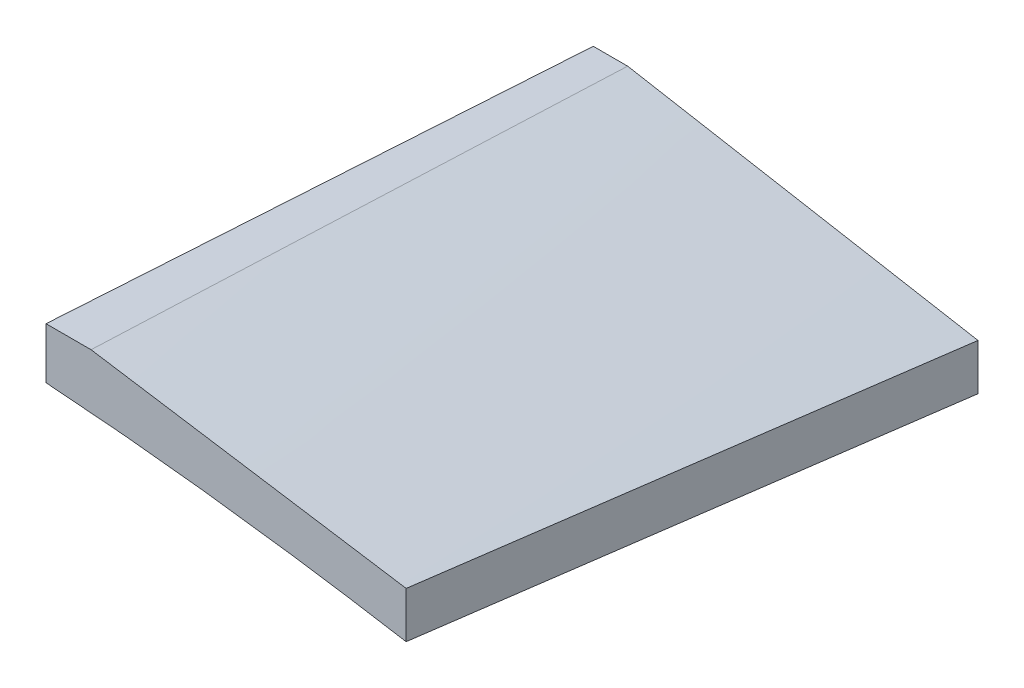
ISO-10303-21;
HEADER;
FILE_DESCRIPTION(('STEP AP214'),'2;1');
FILE_NAME('part.step','',(''),(''),'','','');
FILE_SCHEMA(('AUTOMOTIVE_DESIGN { 1 0 10303 214 1 1 1 1 }'));
ENDSEC;
DATA;
#1=APPLICATION_CONTEXT('core data for automotive mechanical design processes');
#2=APPLICATION_PROTOCOL_DEFINITION('international standard','automotive_design',2000,#1);
#3=PRODUCT_CONTEXT('',#1,'mechanical');
#4=PRODUCT('Part','Part','',(#3));
#5=PRODUCT_RELATED_PRODUCT_CATEGORY('part','',(#4));
#6=PRODUCT_DEFINITION_FORMATION('','',#4);
#7=PRODUCT_DEFINITION_CONTEXT('part definition',#1,'design');
#8=PRODUCT_DEFINITION('design','',#6,#7);
#9=PRODUCT_DEFINITION_SHAPE('','',#8);
#10=(LENGTH_UNIT() NAMED_UNIT(*) SI_UNIT(.MILLI.,.METRE.));
#11=(NAMED_UNIT(*) PLANE_ANGLE_UNIT() SI_UNIT($,.RADIAN.));
#12=(NAMED_UNIT(*) SI_UNIT($,.STERADIAN.) SOLID_ANGLE_UNIT());
#13=UNCERTAINTY_MEASURE_WITH_UNIT(LENGTH_MEASURE(1.E-05),#10,'distance_accuracy_value','');
#14=(GEOMETRIC_REPRESENTATION_CONTEXT(3) GLOBAL_UNCERTAINTY_ASSIGNED_CONTEXT((#13)) GLOBAL_UNIT_ASSIGNED_CONTEXT((#10,
#11,#12)) REPRESENTATION_CONTEXT('',''));
#15=CARTESIAN_POINT('',(0.,0.,0.));
#16=DIRECTION('',(0.,0.,1.));
#17=DIRECTION('',(1.,0.,0.));
#18=AXIS2_PLACEMENT_3D('',#15,#16,#17);
#19=CARTESIAN_POINT('',(0.,0.,477.52));
#20=DIRECTION('',(0.,0.,-1.));
#21=DIRECTION('',(-1.,0.,0.));
#22=AXIS2_PLACEMENT_3D('',#19,#20,#21);
#23=PLANE('',#22);
#24=CARTESIAN_POINT('',(122.012987748225,32.9649433784963,477.52));
#25=CARTESIAN_POINT('',(123.321545248897,32.8786607647076,477.52));
#26=CARTESIAN_POINT('',(124.62981616606,32.7880799662694,477.52));
#27=CARTESIAN_POINT('',(127.245760118867,32.5987877007624,477.52));
#28=CARTESIAN_POINT('',(128.553433158991,32.5000762956549,477.52));
#29=CARTESIAN_POINT('',(131.16761456649,32.2950312707333,477.52));
#30=CARTESIAN_POINT('',(132.47412319288,32.188700945838,477.52));
#31=CARTESIAN_POINT('',(135.086540232052,31.9688943789943,477.52));
#32=CARTESIAN_POINT('',(136.392448643973,31.8554181268355,477.52));
#33=CARTESIAN_POINT('',(139.003285971061,31.6218386650376,477.52));
#34=CARTESIAN_POINT('',(140.308215061148,31.50173740807,477.52));
#35=CARTESIAN_POINT('',(142.917482006573,31.2552859550511,477.52));
#36=CARTESIAN_POINT('',(144.221819862057,31.1289357605477,477.52));
#37=CARTESIAN_POINT('',(146.829670410266,30.8705402268589,477.52));
#38=CARTESIAN_POINT('',(148.13318321504,30.7384960165901,477.52));
#39=CARTESIAN_POINT('',(150.739680426974,30.4692929187873,477.52));
#40=CARTESIAN_POINT('',(152.042664834032,30.3321340302636,477.52));
#41=CARTESIAN_POINT('',(154.647911546336,30.052696205779,477.52));
#42=CARTESIAN_POINT('',(155.950173923956,29.9104179447905,477.52));
#43=CARTESIAN_POINT('',(158.554121027166,29.6206733536585,477.52));
#44=CARTESIAN_POINT('',(159.855805752924,29.4732070250371,477.52));
#45=CARTESIAN_POINT('',(162.458487831246,29.1730656072502,477.52));
#46=CARTESIAN_POINT('',(163.759485223415,29.0203908615777,477.52));
#47=CARTESIAN_POINT('',(166.360846686585,28.7097357006451,477.52));
#48=CARTESIAN_POINT('',(167.661210757489,28.5517552845685,477.52));
#49=CARTESIAN_POINT('',(170.261218478524,28.230366143356,477.52));
#50=CARTESIAN_POINT('',(171.560862154044,28.0669576237585,477.52));
#51=CARTESIAN_POINT('',(174.159436146524,27.7345735555051,477.52));
#52=CARTESIAN_POINT('',(175.458366463669,27.5655980082786,477.52));
#53=CARTESIAN_POINT('',(179.354229747186,27.0501660324726,477.52));
#54=CARTESIAN_POINT('',(181.950046872697,26.6952275002948,477.52));
#55=CARTESIAN_POINT('',(185.841689683171,26.1467332831833,477.52));
#56=CARTESIAN_POINT('',(187.138654755783,25.9612061770152,477.52));
#57=CARTESIAN_POINT('',(189.731826764467,25.5849260150743,477.52));
#58=CARTESIAN_POINT('',(191.028033700634,25.3941729599659,477.52));
#59=CARTESIAN_POINT('',(194.916090818966,24.8143328332849,477.52));
#60=CARTESIAN_POINT('',(197.506825703627,24.4177427176567,477.52));
#61=CARTESIAN_POINT('',(201.391147734804,23.8093169061479,477.52));
#62=CARTESIAN_POINT('',(202.685797417346,23.6042232988153,477.52));
#63=CARTESIAN_POINT('',(205.274408490368,23.1897310203627,477.52));
#64=CARTESIAN_POINT('',(206.5683698808,22.98033234894,477.52));
#65=CARTESIAN_POINT('',(209.1559973362,22.5572470913426,477.52));
#66=CARTESIAN_POINT('',(210.449663189856,22.343559213511,477.52));
#67=CARTESIAN_POINT('',(213.036305992117,21.9120589734394,477.52));
#68=CARTESIAN_POINT('',(214.329282941197,21.6942466140486,477.52));
#69=CARTESIAN_POINT('',(215.621917546117,21.4744225332154,477.52));
#70=B_SPLINE_CURVE_WITH_KNOTS('',3,(#24,#25,#26,#27,#28,#29,#30,#31,#32,#33,#34,#35,#36,#37,#38,
#39,#40,#41,#42,#43,#44,#45,#46,#47,#48,#49,#50,#51,#52,#53,#54,#55,#56,#57,#58,#59,#60,#61,#62,
#63,#64,#65,#66,#67,#68,#69),.UNSPECIFIED.,.F.,.F.,(4,2,2,2,2,2,2,2,2,2,2,2,2,2,2,2,2,2,2,2,2,2,
4),(0.,3.93418541521632,7.86834085179417,11.8008050533507,15.733274873919,19.6645917575364,
23.5959076673278,27.5264476916494,31.4569884764975,35.3870129177525,39.317036205941,
43.2468008098117,47.1765660183761,51.1061825933162,55.0357981593801,62.895598077023,
66.8260922316671,70.7565858866184,78.6192444003735,82.5516217434674,86.4839993630797,
90.4175794984262,94.3511569166042),.UNSPECIFIED.);
#71=CARTESIAN_POINT('',(122.012987748225,32.9649433784963,477.52));
#72=VERTEX_POINT('',#71);
#73=CARTESIAN_POINT('',(215.621917546109,21.4744225332311,477.520000000185));
#74=VERTEX_POINT('',#73);
#75=EDGE_CURVE('E111',#72,#74,#70,.T.);
#76=ORIENTED_EDGE('',*,*,#75,.T.);
#77=DIRECTION('',(0.,1.,0.));
#78=VECTOR('',#77,1.);
#79=CARTESIAN_POINT('',(215.62191754199,9.36643436036436,477.52));
#80=LINE('',#79,#78);
#81=CARTESIAN_POINT('',(215.621917546109,33.4744225332311,477.520000000185));
#82=VERTEX_POINT('',#81);
#83=EDGE_CURVE('E107',#74,#82,#80,.T.);
#84=ORIENTED_EDGE('',*,*,#83,.T.);
#85=CARTESIAN_POINT('',(215.621917546117,33.4744225332154,477.52));
#86=CARTESIAN_POINT('',(208.006711817888,34.6626804700425,477.52));
#87=CARTESIAN_POINT('',(200.391506089658,35.8509384068696,477.52));
#88=CARTESIAN_POINT('',(185.1610946332,38.2274542805238,477.52));
#89=CARTESIAN_POINT('',(177.54588890497,39.4157122173509,477.52));
#90=CARTESIAN_POINT('',(157.86143412108,42.4872260363886,477.52));
#91=CARTESIAN_POINT('',(145.79218506542,44.3704819185992,477.52));
#92=CARTESIAN_POINT('',(133.722936009759,46.2537378008098,477.52));
#93=B_SPLINE_CURVE_WITH_KNOTS('',3,(#85,#86,#87,#88,#89,#90,#91,#92),.UNSPECIFIED.,.F.,.F.,(4,2,
2,4),(0.,23.1220638540165,46.244127708033,82.8900119157991),.UNSPECIFIED.);
#94=CARTESIAN_POINT('',(133.722936009759,46.2537378008098,477.52));
#95=VERTEX_POINT('',#94);
#96=EDGE_CURVE('E97',#82,#95,#93,.T.);
#97=ORIENTED_EDGE('',*,*,#96,.T.);
#98=DIRECTION('',(-1.,0.,0.));
#99=VECTOR('',#98,1.);
#100=CARTESIAN_POINT('',(108.722936009759,46.2537378008098,477.52));
#101=LINE('',#100,#99);
#102=CARTESIAN_POINT('',(122.012987748225,46.2537378008098,477.52));
#103=VERTEX_POINT('',#102);
#104=EDGE_CURVE('E106',#95,#103,#101,.T.);
#105=ORIENTED_EDGE('',*,*,#104,.T.);
#106=DIRECTION('',(0.,-1.,0.));
#107=VECTOR('',#106,1.);
#108=CARTESIAN_POINT('',(122.012987748225,0.,477.52));
#109=LINE('',#108,#107);
#110=EDGE_CURVE('E116',#103,#72,#109,.T.);
#111=ORIENTED_EDGE('',*,*,#110,.T.);
#112=EDGE_LOOP('',(#76,#84,#97,#105,#111));
#113=FACE_BOUND('',#112,.T.);
#114=ADVANCED_FACE('F44',(#113),#23,.F.);
#115=CARTESIAN_POINT('',(122.012987748225,6.34998004884585,335.28));
#116=DIRECTION('',(1.,0.,0.));
#117=DIRECTION('',(0.,1.,0.));
#118=AXIS2_PLACEMENT_3D('',#115,#116,#117);
#119=PLANE('',#118);
#120=CARTESIAN_POINT('',(122.012987752224,23.6750860241779,335.28));
#121=CARTESIAN_POINT('',(122.012987749669,24.4487468752974,347.133365588309));
#122=CARTESIAN_POINT('',(122.012987748614,25.2225198046706,358.986723861705));
#123=CARTESIAN_POINT('',(122.012987747836,26.7703069175755,382.693424651536));
#124=CARTESIAN_POINT('',(122.012987748114,27.5443211011071,394.546767167972));
#125=CARTESIAN_POINT('',(122.012987748336,29.0926078207276,418.253435328198));
#126=CARTESIAN_POINT('',(122.01298774828,29.8668803568164,430.106760971989));
#127=CARTESIAN_POINT('',(122.012987748169,31.4157009424857,453.813394265093));
#128=CARTESIAN_POINT('',(122.012987748114,32.1902489920662,465.666701914406));
#129=CARTESIAN_POINT('',(122.012987748225,32.964943378498,477.520000000027));
#130=B_SPLINE_CURVE_WITH_KNOTS('',3,(#120,#121,#122,#123,#124,#125,#126,#127,#128,#129),
.UNSPECIFIED.,.F.,.F.,(4,2,2,2,4),(0.,35.63576071789,71.2715214188483,106.907282120368,
142.543042838819),.UNSPECIFIED.);
#131=CARTESIAN_POINT('',(122.012987749687,23.6750181217263,335.28));
#132=VERTEX_POINT('',#131);
#133=EDGE_CURVE('E194',#132,#72,#130,.T.);
#134=ORIENTED_EDGE('',*,*,#133,.T.);
#135=ORIENTED_EDGE('',*,*,#110,.F.);
#136=CARTESIAN_POINT('',(122.012987748225,46.2537378008114,477.520000000027));
#137=CARTESIAN_POINT('',(122.012987748225,45.237976977167,460.884315214729));
#138=CARTESIAN_POINT('',(122.012987748225,44.2224901520831,444.24861370111));
#139=CARTESIAN_POINT('',(122.012987748225,42.1920189339372,410.977180021161));
#140=CARTESIAN_POINT('',(122.012987748225,41.1770345408749,394.341447854831));
#141=CARTESIAN_POINT('',(122.012987748225,39.2996441131634,363.56381095303));
#142=CARTESIAN_POINT('',(122.012987748225,38.4371747235634,349.421910082105));
#143=CARTESIAN_POINT('',(122.012987748225,37.5748564158991,335.28));
#144=B_SPLINE_CURVE_WITH_KNOTS('',3,(#136,#137,#138,#139,#140,#141,#142,#143),.UNSPECIFIED.,.F.,
.F.,(4,2,2,4),(0.,50.0000000443876,100.000000059812,142.504528322324),.UNSPECIFIED.);
#145=CARTESIAN_POINT('',(122.012987748225,37.574856415899,335.28));
#146=VERTEX_POINT('',#145);
#147=EDGE_CURVE('E195',#103,#146,#144,.T.);
#148=ORIENTED_EDGE('',*,*,#147,.T.);
#149=DIRECTION('',(0.,1.,0.));
#150=VECTOR('',#149,1.);
#151=CARTESIAN_POINT('',(122.012987748225,25.5726569853662,335.28));
#152=LINE('',#151,#150);
#153=EDGE_CURVE('E199',#132,#146,#152,.T.);
#154=ORIENTED_EDGE('',*,*,#153,.F.);
#155=EDGE_LOOP('',(#134,#135,#148,#154));
#156=FACE_BOUND('',#155,.T.);
#157=ADVANCED_FACE('F185',(#156),#119,.F.);
#158=CARTESIAN_POINT('',(130.956058059283,37.574856415899,335.28));
#159=CARTESIAN_POINT('',(133.722938387168,46.2481983373047,477.52169947526));
#160=CARTESIAN_POINT('',(136.489876885067,54.9368025875343,619.762103902452));
#161=CARTESIAN_POINT('',(139.256928095494,63.6548897190744,762.));
#162=CARTESIAN_POINT('',(126.789391392616,37.5748564158991,335.28));
#163=CARTESIAN_POINT('',(129.556271720501,46.2481983373047,477.52169947526));
#164=CARTESIAN_POINT('',(132.3232102184,54.9368025875343,619.762103902452));
#165=CARTESIAN_POINT('',(135.090261428827,63.6548897190744,762.));
#166=CARTESIAN_POINT('',(118.456058059283,37.574856415899,335.28));
#167=CARTESIAN_POINT('',(121.222938387168,46.2481983373047,477.52169947526));
#168=CARTESIAN_POINT('',(123.989876885067,54.9368025875344,619.762103902452));
#169=CARTESIAN_POINT('',(126.756928095494,63.6548897190745,762.000000000001));
#170=CARTESIAN_POINT('',(105.956058059283,37.5748564158991,335.28));
#171=CARTESIAN_POINT('',(108.722938387168,46.2481983373046,477.52169947526));
#172=CARTESIAN_POINT('',(111.489876885067,54.9368025875342,619.762103902451));
#173=CARTESIAN_POINT('',(114.256928095494,63.6548897190743,761.999999999999));
#174=CARTESIAN_POINT('',(93.4560580592829,37.574856415899,335.28));
#175=CARTESIAN_POINT('',(96.222938387168,46.2481983373047,477.52169947526));
#176=CARTESIAN_POINT('',(98.989876885067,54.9368025875343,619.762103902452));
#177=CARTESIAN_POINT('',(101.756928095494,63.6548897190744,762.));
#178=CARTESIAN_POINT('',(85.1227247259497,37.574856415899,335.28));
#179=CARTESIAN_POINT('',(87.8896050538347,46.2481983373046,477.52169947526));
#180=CARTESIAN_POINT('',(90.6565435517336,54.9368025875343,619.762103902452));
#181=CARTESIAN_POINT('',(93.4235947621608,63.6548897190744,762.));
#182=CARTESIAN_POINT('',(80.956058059283,37.5748564158991,335.28));
#183=CARTESIAN_POINT('',(83.722938387168,46.2481983373047,477.52169947526));
#184=CARTESIAN_POINT('',(86.489876885067,54.9368025875343,619.762103902452));
#185=CARTESIAN_POINT('',(89.2569280954942,63.6548897190744,762.));
#186=B_SPLINE_SURFACE_WITH_KNOTS('',3,3,((#158,#159,#160,#161),(#162,#163,#164,#165),(#166,#167,
#168,#169),(#170,#171,#172,#173),(#174,#175,#176,#177),(#178,#179,#180,#181),(#182,#183,#184,
#185)),.UNSPECIFIED.,.F.,.F.,.F.,(4,1,1,1,4),(4,4),(0.19667758886926,0.224376205647247,
0.252074822425234,0.279773439203221,0.307472055981208),(0.,1.),.UNSPECIFIED.);
#187=CARTESIAN_POINT('',(130.956058059283,37.574856415899,335.28));
#188=CARTESIAN_POINT('',(133.722938387168,46.2481983373047,477.52169947526));
#189=CARTESIAN_POINT('',(136.489876885067,54.9368025875343,619.762103902452));
#190=CARTESIAN_POINT('',(139.256928095494,63.6548897190744,762.));
#191=B_SPLINE_CURVE_WITH_KNOTS('',3,(#187,#188,#189,#190),.UNSPECIFIED.,.F.,.F.,(4,4),(0.,1.),.UNSPECIFIED.);
#192=CARTESIAN_POINT('',(130.956058059283,37.574856415899,335.28));
#193=VERTEX_POINT('',#192);
#194=EDGE_CURVE('E103',#193,#95,#191,.T.);
#195=DIRECTION('',(1.,0.,0.));
#196=VECTOR('',#195,1.);
#197=CARTESIAN_POINT('',(80.956058059283,37.5748564158991,335.28));
#198=LINE('',#197,#196);
#199=EDGE_CURVE('E120',#146,#193,#198,.T.);
#200=ORIENTED_EDGE('',*,*,#147,.F.);
#201=ORIENTED_EDGE('',*,*,#104,.F.);
#202=ORIENTED_EDGE('',*,*,#194,.F.);
#203=ORIENTED_EDGE('',*,*,#199,.F.);
#204=EDGE_LOOP('',(#200,#201,#202,#203));
#205=FACE_BOUND('',#204,.T.);
#206=ADVANCED_FACE('F161',(#205),#186,.T.);
#207=CARTESIAN_POINT('',(222.012987748225,21.3664343603644,335.28));
#208=CARTESIAN_POINT('',(215.621841191138,33.4689125503059,477.52169947526));
#209=CARTESIAN_POINT('',(209.230752804065,45.5866530690714,619.762103902452));
#210=CARTESIAN_POINT('',(202.839777129521,57.7338764691475,762.));
#211=CARTESIAN_POINT('',(214.424910274146,22.7171361983256,335.28));
#212=CARTESIAN_POINT('',(208.796932624141,34.5338530325558,477.52169947526));
#213=CARTESIAN_POINT('',(203.169013144149,46.36583219561,619.762103902452));
#214=CARTESIAN_POINT('',(197.541206376685,58.2272942399747,762.));
#215=CARTESIAN_POINT('',(199.24875532599,25.418539874248,335.28));
#216=CARTESIAN_POINT('',(195.147115490146,36.6637339970556,477.52169947526));
#217=CARTESIAN_POINT('',(191.045533824316,47.9241904486871,619.762103902452));
#218=CARTESIAN_POINT('',(186.944064871014,59.2141297816292,762.));
#219=CARTESIAN_POINT('',(176.484522903754,29.4706453881317,335.28));
#220=CARTESIAN_POINT('',(174.672389789153,39.8585554438053,477.52169947526));
#221=CARTESIAN_POINT('',(172.860314844566,50.2617278283029,619.762103902452));
#222=CARTESIAN_POINT('',(171.048352612508,60.694383094111,762.000000000001));
#223=CARTESIAN_POINT('',(153.720290481519,33.5227509020154,335.28));
#224=CARTESIAN_POINT('',(154.197664088161,43.053376890555,477.52169947526));
#225=CARTESIAN_POINT('',(154.675095864817,52.5992652079185,619.762103902451));
#226=CARTESIAN_POINT('',(155.152640354001,62.1746364065926,761.999999999999));
#227=CARTESIAN_POINT('',(138.544135533361,36.2241545779378,335.28));
#228=CARTESIAN_POINT('',(140.547846954166,45.1832578550548,477.52169947526));
#229=CARTESIAN_POINT('',(142.551616544983,54.1576234609957,619.762103902452));
#230=CARTESIAN_POINT('',(144.55549884833,63.1614719482472,762.));
#231=CARTESIAN_POINT('',(130.956058059283,37.574856415899,335.28));
#232=CARTESIAN_POINT('',(133.722938387168,46.2481983373047,477.52169947526));
#233=CARTESIAN_POINT('',(136.489876885067,54.9368025875343,619.762103902452));
#234=CARTESIAN_POINT('',(139.256928095494,63.6548897190744,762.));
#235=B_SPLINE_SURFACE_WITH_KNOTS('',3,3,((#207,#208,#209,#210),(#211,#212,#213,#214),(#215,#216,
#217,#218),(#219,#220,#221,#222),(#223,#224,#225,#226),(#227,#228,#229,#230),(#231,#232,#233,
#234)),.UNSPECIFIED.,.F.,.F.,.F.,(4,1,1,1,4),(4,4),(0.0265906721068675,0.0691124012974655,
0.111634130488064,0.154155859678662,0.19667758886926),(0.,1.),.UNSPECIFIED.);
#236=CARTESIAN_POINT('',(222.012987748225,21.3664343603644,335.28));
#237=CARTESIAN_POINT('',(215.621841191138,33.4689125503059,477.52169947526));
#238=CARTESIAN_POINT('',(209.230752804065,45.5866530690714,619.762103902452));
#239=CARTESIAN_POINT('',(202.839777129521,57.7338764691475,762.));
#240=B_SPLINE_CURVE_WITH_KNOTS('',3,(#236,#237,#238,#239),.UNSPECIFIED.,.F.,.F.,(4,4),(0.,1.),.UNSPECIFIED.);
#241=CARTESIAN_POINT('',(222.012987748225,21.3664343603644,335.28));
#242=VERTEX_POINT('',#241);
#243=EDGE_CURVE('E101',#242,#82,#240,.T.);
#244=DIRECTION('',(0.984524243422216,-0.175248435410745,0.));
#245=VECTOR('',#244,1.);
#246=CARTESIAN_POINT('',(130.956058059283,37.574856415899,335.28));
#247=LINE('',#246,#245);
#248=EDGE_CURVE('E69',#193,#242,#247,.T.);
#249=ORIENTED_EDGE('',*,*,#96,.F.);
#250=ORIENTED_EDGE('',*,*,#243,.F.);
#251=ORIENTED_EDGE('',*,*,#248,.F.);
#252=ORIENTED_EDGE('',*,*,#194,.T.);
#253=EDGE_LOOP('',(#249,#250,#251,#252));
#254=FACE_BOUND('',#253,.T.);
#255=ADVANCED_FACE('F99',(#254),#235,.T.);
#256=CARTESIAN_POINT('',(82.2804747987484,25.5726569853662,335.28));
#257=DIRECTION('',(0.,0.,1.));
#258=DIRECTION('',(1.,0.,0.));
#259=AXIS2_PLACEMENT_3D('',#256,#257,#258);
#260=PLANE('',#259);
#261=CARTESIAN_POINT('',(222.012987748225,9.36643436036436,335.28));
#262=CARTESIAN_POINT('',(219.305323120639,9.8828652591309,335.28));
#263=CARTESIAN_POINT('',(206.541017082642,12.2763586799121,335.28));
#264=CARTESIAN_POINT('',(183.689198022509,16.212343466344,335.28));
#265=CARTESIAN_POINT('',(153.375302710596,20.4499223705636,335.28));
#266=CARTESIAN_POINT('',(123.023877202586,23.8279645312959,335.28));
#267=CARTESIAN_POINT('',(97.638725879298,25.4476392822273,335.28));
#268=CARTESIAN_POINT('',(77.2944986596226,25.6578361740897,335.28));
#269=CARTESIAN_POINT('',(61.9927675074224,25.2149792636771,335.28));
#270=CARTESIAN_POINT('',(46.6346065949384,24.0544751800587,335.28));
#271=CARTESIAN_POINT('',(33.8125116405927,22.3102129525216,335.28));
#272=CARTESIAN_POINT('',(23.5489595650354,20.117258737212,335.28));
#273=CARTESIAN_POINT('',(15.7465052754672,18.0444275466148,335.28));
#274=CARTESIAN_POINT('',(9.09525322528811,15.5030018611269,335.28));
#275=CARTESIAN_POINT('',(3.30584359707731,12.3040921411337,335.28));
#276=CARTESIAN_POINT('',(-1.89753019369014,6.52317210486126,335.28));
#277=CARTESIAN_POINT('',(2.9085237132377,0.95641830810498,335.28));
#278=CARTESIAN_POINT('',(8.28725344569942,-1.74745196493542,335.28));
#279=CARTESIAN_POINT('',(14.6658599853843,-3.91999232805113,335.28));
#280=CARTESIAN_POINT('',(22.2470318994588,-5.63336697382817,335.28));
#281=CARTESIAN_POINT('',(32.3523049598298,-7.28369412199933,335.28));
#282=CARTESIAN_POINT('',(41.2795618130036,-8.35846009329233,335.28));
#283=CARTESIAN_POINT('',(47.6859765478255,-8.94400249529088,335.28));
#284=CARTESIAN_POINT('',(49.0219891897218,-9.05897370885618,335.28));
#285=B_SPLINE_CURVE_WITH_KNOTS('',3,(#261,#262,#263,#264,#265,#266,#267,#268,#269,#270,#271,
#272,#273,#274,#275,#276,#277,#278,#279,#280,#281,#282,#283,#284),.UNSPECIFIED.,.F.,.F.,(4,1,1,
1,1,1,1,1,1,1,1,1,1,1,1,1,1,1,1,1,1,4),(0.135902519716628,0.149206319909966,0.198581096615965,
0.247805170456833,0.296916574601493,0.345952721793533,0.370491625569911,0.395091203654929,
0.41981479582396,0.444798575016595,0.457489818915221,0.47040640543549,0.483879408669829,
0.491264120322896,0.503458853294665,0.513609129403887,0.520450990700287,0.533235387615153,
0.545691039147803,0.558031884237173,0.582609167247894,0.589081134929683),.UNSPECIFIED.);
#286=CARTESIAN_POINT('',(222.012987748225,9.36643436036436,335.28));
#287=VERTEX_POINT('',#286);
#288=EDGE_CURVE('E11',#287,#132,#285,.T.);
#289=ORIENTED_EDGE('',*,*,#288,.T.);
#290=ORIENTED_EDGE('',*,*,#153,.T.);
#291=ORIENTED_EDGE('',*,*,#199,.T.);
#292=ORIENTED_EDGE('',*,*,#248,.T.);
#293=DIRECTION('',(0.,-1.,0.));
#294=VECTOR('',#293,1.);
#295=CARTESIAN_POINT('',(222.012987748225,9.36643436036436,335.28));
#296=LINE('',#295,#294);
#297=EDGE_CURVE('E57',#242,#287,#296,.T.);
#298=ORIENTED_EDGE('',*,*,#297,.T.);
#299=EDGE_LOOP('',(#289,#290,#291,#292,#298));
#300=FACE_BOUND('',#299,.T.);
#301=ADVANCED_FACE('F160',(#300),#260,.F.);
#302=CARTESIAN_POINT('',(9.29077044004429E-07,6.34998004884775,335.28));
#303=CARTESIAN_POINT('',(8.33297207421032,14.5787844685806,477.52169947526));
#304=CARTESIAN_POINT('',(16.6660013893575,22.8228512171374,619.762103902452));
#305=CARTESIAN_POINT('',(24.9991434170329,31.0964008470047,762.));
#306=CARTESIAN_POINT('',(9.29077600369592E-07,7.45438325082316,335.28));
#307=CARTESIAN_POINT('',(8.33297207421069,15.6111681299376,477.52169947526));
#308=CARTESIAN_POINT('',(16.6660013893577,23.783215337876,619.762103902452));
#309=CARTESIAN_POINT('',(24.9991434170329,31.9847454271249,762.));
#310=CARTESIAN_POINT('',(0.969916519496457,9.6613167038059,335.28));
#311=CARTESIAN_POINT('',(9.22997388777417,17.6892352496878,477.521699475259));
#312=CARTESIAN_POINT('',(17.4900894260658,25.7324161243937,619.762103902451));
#313=CARTESIAN_POINT('',(25.7503176768857,33.8050798804101,762.));
#314=CARTESIAN_POINT('',(3.44848156516794,12.0366302116868,335.28));
#315=CARTESIAN_POINT('',(11.5121687647093,19.9379477005165,477.52169947526));
#316=CARTESIAN_POINT('',(19.5759141342645,27.8545275181702,619.762103902452));
#317=CARTESIAN_POINT('',(27.639772216348,35.8005902171344,762.000000000001));
#318=CARTESIAN_POINT('',(5.45941166538086,13.4428022435293,335.28));
#319=CARTESIAN_POINT('',(13.3630371949687,21.2745392258276,477.521699475259));
#320=CARTESIAN_POINT('',(21.2667208945703,29.1215385369498,619.762103902452));
#321=CARTESIAN_POINT('',(29.1705173067003,36.9980207293825,762.));
#322=CARTESIAN_POINT('',(6.98203766683405,14.316970710559,335.28));
#323=CARTESIAN_POINT('',(14.7696273274846,22.112594899526,477.52169947526));
#324=CARTESIAN_POINT('',(22.557275158149,29.923481417317,619.762103902452));
#325=CARTESIAN_POINT('',(30.3450357013417,37.7638508164184,762.));
#326=CARTESIAN_POINT('',(8.54472942418297,15.0888371575498,335.28));
#327=CARTESIAN_POINT('',(16.217370772052,22.8607836546203,477.52169947526));
#328=CARTESIAN_POINT('',(23.8900702899349,30.6479924805147,619.762103902452));
#329=CARTESIAN_POINT('',(31.5628825203461,38.4646841877197,762.));
#330=CARTESIAN_POINT('',(10.1582127248828,15.8184229079955,335.28));
#331=CARTESIAN_POINT('',(17.7118720922566,23.5698254554367,477.521699475259));
#332=CARTESIAN_POINT('',(25.2655896296443,31.3364903317018,619.762103902451));
#333=CARTESIAN_POINT('',(32.8194198795603,39.1326380892775,761.999999999999));
#334=CARTESIAN_POINT('',(11.8098506399446,16.4960217707987,335.28));
#335=CARTESIAN_POINT('',(19.2427460811811,24.2313837922629,477.521699475261));
#336=CARTESIAN_POINT('',(26.6756996924314,31.9820081425512,619.762103902453));
#337=CARTESIAN_POINT('',(34.1087660162101,39.76211537415,762.000000000002));
#338=CARTESIAN_POINT('',(13.4900691645311,17.1289319071832,335.28));
#339=CARTESIAN_POINT('',(20.801220906549,24.8518102555458,477.521699475259));
#340=CARTESIAN_POINT('',(28.1124308185809,32.5899509327323,619.762103902451));
#341=CARTESIAN_POINT('',(35.423753443141,40.3575744912294,761.999999999999));
#342=CARTESIAN_POINT('',(15.1903900958544,17.7169000721208,335.28));
#343=CARTESIAN_POINT('',(22.3776261706481,25.4304482833263,477.52169947526));
#344=CARTESIAN_POINT('',(29.5649204154557,33.1592588233557,619.762103902452));
#345=CARTESIAN_POINT('',(36.7523273727916,40.9175522446957,761.999999999999));
#346=CARTESIAN_POINT('',(17.465921328655,18.443907318319,335.28));
#347=CARTESIAN_POINT('',(24.4893873514633,26.1494155039185,477.52169947526));
#348=CARTESIAN_POINT('',(31.5129115442856,33.870186018342,619.762103902453));
#349=CARTESIAN_POINT('',(38.5365484496361,41.620439414076,762.000000000001));
#350=CARTESIAN_POINT('',(20.3261253650035,19.2567063001384,335.28));
#351=CARTESIAN_POINT('',(27.1442798687524,26.9590316546654,477.521699475259));
#352=CARTESIAN_POINT('',(33.9624925425152,34.6766193380163,619.76210390245));
#353=CARTESIAN_POINT('',(40.7808179288063,42.4236899026778,761.999999999998));
#354=CARTESIAN_POINT('',(23.7782685903277,20.118367205322,335.28));
#355=CARTESIAN_POINT('',(30.3520648212409,27.826403434635,477.52169947526));
#356=CARTESIAN_POINT('',(36.9259192221679,35.549701992772,619.762103902453));
#357=CARTESIAN_POINT('',(43.4998863356233,43.3024834322195,762.000000000001));
#358=CARTESIAN_POINT('',(27.2569743923509,20.9064140542042,335.28));
#359=CARTESIAN_POINT('',(33.5853102584017,28.6257194399167,477.52169947526));
#360=CARTESIAN_POINT('',(39.9137042944664,36.3602871544532,619.762103902451));
#361=CARTESIAN_POINT('',(46.2422110430595,44.1243377503001,761.999999999999));
#362=CARTESIAN_POINT('',(30.7542530905361,21.6165466303187,335.279999999999));
#363=CARTESIAN_POINT('',(36.8375774721128,29.3523453451718,477.521699475259));
#364=CARTESIAN_POINT('',(42.9209600237033,37.103406388849,619.762103902451));
#365=CARTESIAN_POINT('',(49.0044552878221,44.8839503138367,762.));
#366=CARTESIAN_POINT('',(34.2664636940487,22.2460759079554,335.280000000001));
#367=CARTESIAN_POINT('',(40.1050244166742,30.0039988320751,477.52169947526));
#368=CARTESIAN_POINT('',(45.9436433093136,37.7771840850187,619.762103902452));
#369=CARTESIAN_POINT('',(51.7823749144814,45.579852219273,762.));
#370=CARTESIAN_POINT('',(37.7902260736038,22.8004936568621,335.279999999999));
#371=CARTESIAN_POINT('',(43.384705041758,30.5859470440672,477.521699475259));
#372=CARTESIAN_POINT('',(48.979242179926,38.3866627600962,619.762103902451));
#373=CARTESIAN_POINT('',(54.5738920306224,46.2168613574358,761.999999999999));
#374=CARTESIAN_POINT('',(41.3242497765985,23.2878811261495,335.28));
#375=CARTESIAN_POINT('',(46.675131793767,31.1056757552862,477.52169947526));
#376=CARTESIAN_POINT('',(52.0260719809494,38.9387327132469,619.762103902453));
#377=CARTESIAN_POINT('',(57.3771248806601,46.8012725525181,762.000000000001));
#378=CARTESIAN_POINT('',(44.8658239828752,23.7149223381359,335.28));
#379=CARTESIAN_POINT('',(49.9736457372606,31.5693936302263,477.521699475259));
#380=CARTESIAN_POINT('',(55.0815256616599,39.4391272511406,619.762103902451));
#381=CARTESIAN_POINT('',(60.1895182985876,47.3383437533655,761.999999999999));
#382=CARTESIAN_POINT('',(48.4136829142244,24.0896238833925,335.28));
#383=CARTESIAN_POINT('',(53.2790352364492,31.9845911908484,477.52169947526));
#384=CARTESIAN_POINT('',(58.144445728688,39.8948208271283,619.762103902453));
#385=CARTESIAN_POINT('',(63.009968933455,47.8345333447187,762.000000000001));
#386=CARTESIAN_POINT('',(53.1486242463732,24.5260190039242,335.28));
#387=CARTESIAN_POINT('',(57.6912752508218,32.4792550117327,477.521699475259));
#388=CARTESIAN_POINT('',(62.2339844252844,40.4477533483652,619.762103902451));
#389=CARTESIAN_POINT('',(66.7768063122753,48.4457345663082,761.999999999999));
#390=CARTESIAN_POINT('',(59.0789436792651,24.9574757661192,335.28));
#391=CARTESIAN_POINT('',(63.2200221820315,32.9915421905065,477.52169947526));
#392=CARTESIAN_POINT('',(67.3611588548119,41.0408709437178,619.762103902453));
#393=CARTESIAN_POINT('',(71.5024082401206,49.1196825782396,762.000000000001));
#394=CARTESIAN_POINT('',(66.2030814892412,25.3140522243183,335.28));
#395=CARTESIAN_POINT('',(69.8642211934628,33.4561192258002,477.52169947526));
#396=CARTESIAN_POINT('',(73.5254190676983,41.613448556106,619.762103902451));
#397=CARTESIAN_POINT('',(77.1867296544622,49.8002607677224,761.999999999999));
#398=CARTESIAN_POINT('',(73.3339674682549,25.523312736422,335.279999999999));
#399=CARTESIAN_POINT('',(76.5177056557658,33.7833803999775,477.52169947526));
#400=CARTESIAN_POINT('',(79.7015020132907,42.0587103923571,619.762103902452));
#401=CARTESIAN_POINT('',(82.8854110833438,50.3635232660471,762.000000000001));
#402=CARTESIAN_POINT('',(80.4669900342226,25.5957976291351,335.280000000001));
#403=CARTESIAN_POINT('',(83.1755672296286,33.9831036079315,477.52169947526));
#404=CARTESIAN_POINT('',(85.8842025950485,42.3856719155519,619.762103902451));
#405=CARTESIAN_POINT('',(88.5929506729966,50.8177231044828,761.999999999999));
#406=CARTESIAN_POINT('',(87.6002131526684,25.5406730290278,335.279999999999));
#407=CARTESIAN_POINT('',(89.8360561254533,34.0637012643954,477.521699475259));
#408=CARTESIAN_POINT('',(92.071957268252,42.6019918285869,619.762103902452));
#409=CARTESIAN_POINT('',(94.3079711235791,51.1697652740891,762.));
#410=CARTESIAN_POINT('',(94.731344048156,25.3623320865792,335.28));
#411=CARTESIAN_POINT('',(96.4968287829496,34.0292359395454,477.52169947526));
#412=CARTESIAN_POINT('',(98.262371687757,42.7114021213355,619.762103902453));
#413=CARTESIAN_POINT('',(100.028027305093,51.4230511844363,762.000000000001));
#414=CARTESIAN_POINT('',(101.858719846003,25.0679177013017,335.28));
#415=CARTESIAN_POINT('',(103.156275912104,33.8864442696627,477.521699475259));
#416=CARTESIAN_POINT('',(104.453890148219,42.7202331668477,619.762103902451));
#417=CARTESIAN_POINT('',(105.751617096862,51.5835049453433,761.999999999999));
#418=CARTESIAN_POINT('',(108.98145520224,24.6671471282029,335.28));
#419=CARTESIAN_POINT('',(109.813353159231,33.6444202192184,477.52169947526));
#420=CARTESIAN_POINT('',(110.645309286237,42.6369556390579,619.762103902452));
#421=CARTESIAN_POINT('',(111.477378125771,51.6589739402079,762.));
#422=CARTESIAN_POINT('',(116.098371799005,24.1694505600281,335.28));
#423=CARTESIAN_POINT('',(116.466790352252,33.3119415656027,477.521699475259));
#424=CARTESIAN_POINT('',(116.835267075513,42.4696949000013,619.762103902452));
#425=CARTESIAN_POINT('',(117.203856511302,51.6569311157104,762.));
#426=CARTESIAN_POINT('',(123.208750062991,23.5842845444573,335.280000000001));
#427=CARTESIAN_POINT('',(123.115731295253,32.8978674091282,477.52169947526));
#428=CARTESIAN_POINT('',(123.022770697529,42.2267126026231,619.762103902452));
#429=CARTESIAN_POINT('',(122.929922812333,51.5850406774286,762.));
#430=CARTESIAN_POINT('',(130.310988961638,22.921250348438,335.279999999999));
#431=CARTESIAN_POINT('',(129.758512205833,32.411084966105,477.521699475259));
#432=CARTESIAN_POINT('',(129.206093620042,41.9161819125961,619.762103902451));
#433=CARTESIAN_POINT('',(128.65378774678,51.4507617403976,761.999999999999));
#434=CARTESIAN_POINT('',(137.406778455928,22.1873993770708,335.28));
#435=CARTESIAN_POINT('',(136.396633479512,31.8582341206284,477.52169947526));
#436=CARTESIAN_POINT('',(135.38654667311,41.54433119301,619.762103902452));
#437=CARTESIAN_POINT('',(134.376572579236,51.2599111467022,762.));
#438=CARTESIAN_POINT('',(144.494202314858,21.3909417632401,335.28));
#439=CARTESIAN_POINT('',(143.028083804604,31.2468918148837,477.521699475259));
#440=CARTESIAN_POINT('',(141.562023464364,41.1181041953513,619.762103902451));
#441=CARTESIAN_POINT('',(140.096075836652,51.0187994571294,761.999999999999));
#442=CARTESIAN_POINT('',(153.939247988962,20.2535758150893,335.280000000001));
#443=CARTESIAN_POINT('',(151.866994129968,30.3616126018442,477.52169947526));
#444=CARTESIAN_POINT('',(149.794798440988,40.4849117174231,619.762103902452));
#445=CARTESIAN_POINT('',(147.722715464536,50.6376937143126,762.));
#446=CARTESIAN_POINT('',(165.724997703164,18.7151343960646,335.279999999999));
#447=CARTESIAN_POINT('',(162.898490334251,29.1457414177919,477.521699475259));
#448=CARTESIAN_POINT('',(160.072041135351,39.5916107683432,619.762103902452));
#449=CARTESIAN_POINT('',(157.24570464898,50.066963000205,762.));
#450=CARTESIAN_POINT('',(179.846765687905,16.6757724994209,335.28));
#451=CARTESIAN_POINT('',(176.120250526412,27.5053845131493,477.52169947526));
#452=CARTESIAN_POINT('',(172.393793534932,38.3502588557017,619.762103902452));
#453=CARTESIAN_POINT('',(168.667449255981,49.2246160795646,762.));
#454=CARTESIAN_POINT('',(193.933550227643,14.4286098676329,335.28));
#455=CARTESIAN_POINT('',(189.313154974693,25.670161061974,477.52169947526));
#456=CARTESIAN_POINT('',(184.692817891756,36.926974585139,619.762103902452));
#457=CARTESIAN_POINT('',(180.072593521347,48.2132709896145,762.));
#458=CARTESIAN_POINT('',(207.990516041457,11.9899167572326,335.28));
#459=CARTESIAN_POINT('',(202.481883538507,23.6559759384714,477.52169947526));
#460=CARTESIAN_POINT('',(196.97330920557,35.3372974485342,619.762103902452));
#461=CARTESIAN_POINT('',(191.464847585162,47.0481018399075,762.));
#462=CARTESIAN_POINT('',(217.341938436305,10.2573401873864,335.28));
#463=CARTESIAN_POINT('',(211.244446134889,22.2133306080831,477.52169947526));
#464=CARTESIAN_POINT('',(205.147012003487,34.1845833576038,619.762103902452));
#465=CARTESIAN_POINT('',(199.049690584614,46.1853189884351,762.));
#466=CARTESIAN_POINT('',(222.012987748225,9.36643436036436,335.28));
#467=CARTESIAN_POINT('',(215.621841191138,21.4689125503059,477.52169947526));
#468=CARTESIAN_POINT('',(209.230752804065,33.5866530690714,619.762103902452));
#469=CARTESIAN_POINT('',(202.839777129521,45.7338764691475,762.));
#470=B_SPLINE_SURFACE_WITH_KNOTS('',3,3,((#302,#303,#304,#305),(#306,#307,#308,#309),(#310,#311,
#312,#313),(#314,#315,#316,#317),(#318,#319,#320,#321),(#322,#323,#324,#325),(#326,#327,#328,
#329),(#330,#331,#332,#333),(#334,#335,#336,#337),(#338,#339,#340,#341),(#342,#343,#344,#345),
(#346,#347,#348,#349),(#350,#351,#352,#353),(#354,#355,#356,#357),(#358,#359,#360,#361),(#362,
#363,#364,#365),(#366,#367,#368,#369),(#370,#371,#372,#373),(#374,#375,#376,#377),(#378,#379,
#380,#381),(#382,#383,#384,#385),(#386,#387,#388,#389),(#390,#391,#392,#393),(#394,#395,#396,
#397),(#398,#399,#400,#401),(#402,#403,#404,#405),(#406,#407,#408,#409),(#410,#411,#412,#413),
(#414,#415,#416,#417),(#418,#419,#420,#421),(#422,#423,#424,#425),(#426,#427,#428,#429),(#430,
#431,#432,#433),(#434,#435,#436,#437),(#438,#439,#440,#441),(#442,#443,#444,#445),(#446,#447,
#448,#449),(#450,#451,#452,#453),(#454,#455,#456,#457),(#458,#459,#460,#461),(#462,#463,#464,
#465),(#466,#467,#468,#469)),.UNSPECIFIED.,.F.,.F.,.F.,(4,1,1,1,1,1,1,1,1,1,1,1,1,1,1,1,1,1,1,1,
1,1,1,1,1,1,1,1,1,1,1,1,1,1,1,1,1,1,1,4),(4,4),(0.548393358469235,0.555449712243154,
0.562506066017072,0.566034242904031,0.56956241979099,0.573090596677949,0.576618773564908,
0.580146950451867,0.583675127338826,0.587203304225785,0.590731481112744,0.597787834886663,
0.604844188660581,0.611900542434499,0.618956896208417,0.626013249982335,0.633069603756254,
0.640125957530172,0.64718231130409,0.654238665078008,0.661295018851926,0.675407726399763,
0.689520433947599,0.703633141495436,0.717745849043272,0.731858556591108,0.745971264138945,
0.760083971686781,0.774196679234618,0.788309386782454,0.80242209433029,0.816534801878127,
0.830647509425963,0.8447602169738,0.858872924521636,0.887098339617309,0.915323754712982,
0.943549169808654,0.971774584904327,1.),(0.,1.),.UNSPECIFIED.);
#471=CARTESIAN_POINT('',(222.012987748225,9.36643436036436,335.28));
#472=CARTESIAN_POINT('',(215.621841191138,21.4689125503059,477.52169947526));
#473=CARTESIAN_POINT('',(209.230752804065,33.5866530690714,619.762103902452));
#474=CARTESIAN_POINT('',(202.839777129521,45.7338764691475,762.));
#475=B_SPLINE_CURVE_WITH_KNOTS('',3,(#471,#472,#473,#474),.UNSPECIFIED.,.F.,.F.,(4,4),(0.,1.),.UNSPECIFIED.);
#476=EDGE_CURVE('E125',#287,#74,#475,.T.);
#477=ORIENTED_EDGE('',*,*,#133,.F.);
#478=ORIENTED_EDGE('',*,*,#288,.F.);
#479=ORIENTED_EDGE('',*,*,#476,.T.);
#480=ORIENTED_EDGE('',*,*,#75,.F.);
#481=EDGE_LOOP('',(#477,#478,#479,#480));
#482=FACE_BOUND('',#481,.T.);
#483=ADVANCED_FACE('F166',(#482),#470,.T.);
#484=CARTESIAN_POINT('',(222.012987748225,9.36643436036436,335.28));
#485=DIRECTION('',(0.998992101682105,0.,0.0448863094581294));
#486=DIRECTION('',(0.,1.,0.));
#487=AXIS2_PLACEMENT_3D('',#484,#485,#486);
#488=PLANE('',#487);
#489=ORIENTED_EDGE('',*,*,#83,.F.);
#490=ORIENTED_EDGE('',*,*,#476,.F.);
#491=ORIENTED_EDGE('',*,*,#297,.F.);
#492=ORIENTED_EDGE('',*,*,#243,.T.);
#493=EDGE_LOOP('',(#489,#490,#491,#492));
#494=FACE_BOUND('',#493,.T.);
#495=ADVANCED_FACE('F46',(#494),#488,.T.);
#496=CLOSED_SHELL('',(#114,#157,#206,#255,#301,#483,#495));
#497=MANIFOLD_SOLID_BREP('B2',#496);
#498=ADVANCED_BREP_SHAPE_REPRESENTATION('',(#18,#497),#14);
#499=SHAPE_DEFINITION_REPRESENTATION(#9,#498);
ENDSEC;
END-ISO-10303-21;
